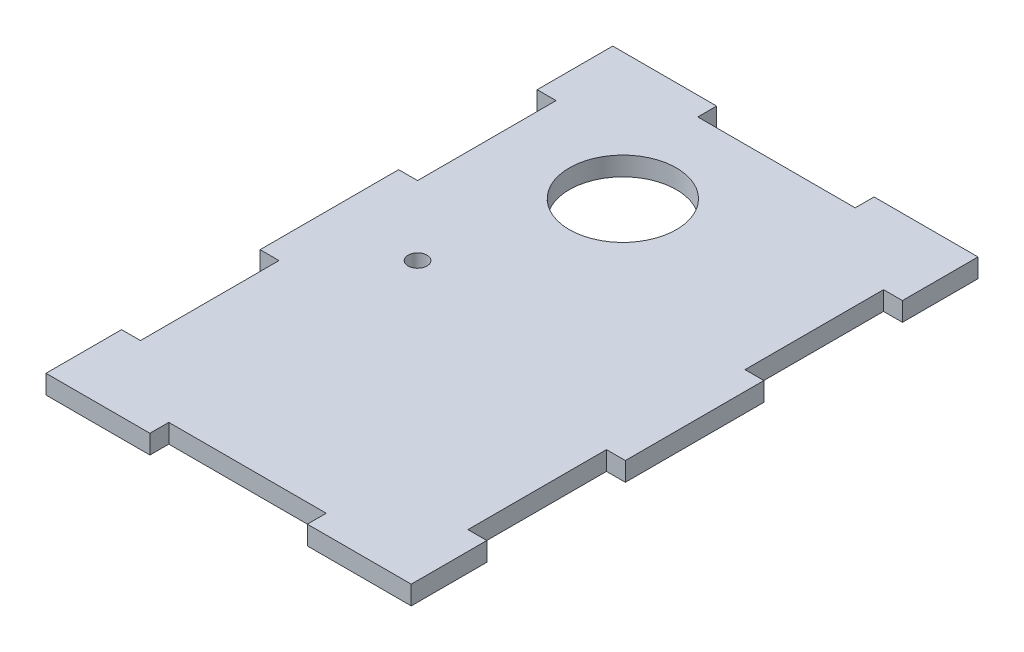
ISO-10303-21;
HEADER;
FILE_DESCRIPTION(('STEP AP214'),'2;1');
FILE_NAME('part.step','',(''),(''),'','','');
FILE_SCHEMA(('AUTOMOTIVE_DESIGN { 1 0 10303 214 1 1 1 1 }'));
ENDSEC;
DATA;
#1=APPLICATION_CONTEXT('core data for automotive mechanical design processes');
#2=APPLICATION_PROTOCOL_DEFINITION('international standard','automotive_design',2000,#1);
#3=PRODUCT_CONTEXT('',#1,'mechanical');
#4=PRODUCT('Part','Part','',(#3));
#5=PRODUCT_RELATED_PRODUCT_CATEGORY('part','',(#4));
#6=PRODUCT_DEFINITION_FORMATION('','',#4);
#7=PRODUCT_DEFINITION_CONTEXT('part definition',#1,'design');
#8=PRODUCT_DEFINITION('design','',#6,#7);
#9=PRODUCT_DEFINITION_SHAPE('','',#8);
#10=(LENGTH_UNIT() NAMED_UNIT(*) SI_UNIT(.MILLI.,.METRE.));
#11=(NAMED_UNIT(*) PLANE_ANGLE_UNIT() SI_UNIT($,.RADIAN.));
#12=(NAMED_UNIT(*) SI_UNIT($,.STERADIAN.) SOLID_ANGLE_UNIT());
#13=UNCERTAINTY_MEASURE_WITH_UNIT(LENGTH_MEASURE(1.E-05),#10,'distance_accuracy_value','');
#14=(GEOMETRIC_REPRESENTATION_CONTEXT(3) GLOBAL_UNCERTAINTY_ASSIGNED_CONTEXT((#13)) GLOBAL_UNIT_ASSIGNED_CONTEXT((#10,
#11,#12)) REPRESENTATION_CONTEXT('',''));
#15=CARTESIAN_POINT('',(0.,0.,0.));
#16=DIRECTION('',(0.,0.,1.));
#17=DIRECTION('',(1.,0.,0.));
#18=AXIS2_PLACEMENT_3D('',#15,#16,#17);
#19=CARTESIAN_POINT('',(0.,3.,0.));
#20=DIRECTION('',(0.,-1.,0.));
#21=DIRECTION('',(0.,0.,-1.));
#22=AXIS2_PLACEMENT_3D('',#19,#20,#21);
#23=PLANE('',#22);
#24=DIRECTION('',(1.,0.,0.));
#25=VECTOR('',#24,1.);
#26=CARTESIAN_POINT('',(-26.,3.,12.));
#27=LINE('',#26,#25);
#28=CARTESIAN_POINT('',(-26.,3.,12.));
#29=VERTEX_POINT('',#28);
#30=CARTESIAN_POINT('',(-23.,3.,12.));
#31=VERTEX_POINT('',#30);
#32=EDGE_CURVE('E305',#29,#31,#27,.T.);
#33=ORIENTED_EDGE('',*,*,#32,.T.);
#34=DIRECTION('',(0.,0.,1.));
#35=VECTOR('',#34,1.);
#36=CARTESIAN_POINT('',(-23.,3.,12.));
#37=LINE('',#36,#35);
#38=CARTESIAN_POINT('',(-23.,3.,34.));
#39=VERTEX_POINT('',#38);
#40=EDGE_CURVE('E153',#31,#39,#37,.T.);
#41=ORIENTED_EDGE('',*,*,#40,.T.);
#42=DIRECTION('',(-1.,0.,0.));
#43=VECTOR('',#42,1.);
#44=CARTESIAN_POINT('',(-23.,3.,34.));
#45=LINE('',#44,#43);
#46=CARTESIAN_POINT('',(-26.,3.,34.));
#47=VERTEX_POINT('',#46);
#48=EDGE_CURVE('E380',#39,#47,#45,.T.);
#49=ORIENTED_EDGE('',*,*,#48,.T.);
#50=DIRECTION('',(0.,0.,1.));
#51=VECTOR('',#50,1.);
#52=CARTESIAN_POINT('',(-26.,3.,34.));
#53=LINE('',#52,#51);
#54=CARTESIAN_POINT('',(-26.,3.,56.));
#55=VERTEX_POINT('',#54);
#56=EDGE_CURVE('E399',#47,#55,#53,.T.);
#57=ORIENTED_EDGE('',*,*,#56,.T.);
#58=DIRECTION('',(1.,0.,0.));
#59=VECTOR('',#58,1.);
#60=CARTESIAN_POINT('',(-26.,3.,56.));
#61=LINE('',#60,#59);
#62=CARTESIAN_POINT('',(-23.,3.,56.));
#63=VERTEX_POINT('',#62);
#64=EDGE_CURVE('E396',#55,#63,#61,.T.);
#65=ORIENTED_EDGE('',*,*,#64,.T.);
#66=DIRECTION('',(0.,0.,1.));
#67=VECTOR('',#66,1.);
#68=CARTESIAN_POINT('',(-23.,3.,56.));
#69=LINE('',#68,#67);
#70=CARTESIAN_POINT('',(-23.,3.,78.));
#71=VERTEX_POINT('',#70);
#72=EDGE_CURVE('E398',#63,#71,#69,.T.);
#73=ORIENTED_EDGE('',*,*,#72,.T.);
#74=DIRECTION('',(-1.,0.,0.));
#75=VECTOR('',#74,1.);
#76=CARTESIAN_POINT('',(-23.,3.,78.));
#77=LINE('',#76,#75);
#78=CARTESIAN_POINT('',(-26.,3.,78.));
#79=VERTEX_POINT('',#78);
#80=EDGE_CURVE('E401',#71,#79,#77,.T.);
#81=ORIENTED_EDGE('',*,*,#80,.T.);
#82=DIRECTION('',(0.,0.,1.));
#83=VECTOR('',#82,1.);
#84=CARTESIAN_POINT('',(-26.,3.,78.));
#85=LINE('',#84,#83);
#86=CARTESIAN_POINT('',(-26.,3.,90.));
#87=VERTEX_POINT('',#86);
#88=EDGE_CURVE('E407',#79,#87,#85,.T.);
#89=ORIENTED_EDGE('',*,*,#88,.T.);
#90=DIRECTION('',(1.,0.,0.));
#91=VECTOR('',#90,1.);
#92=CARTESIAN_POINT('',(-26.,3.,90.));
#93=LINE('',#92,#91);
#94=CARTESIAN_POINT('',(-9.49999999999999,3.,90.));
#95=VERTEX_POINT('',#94);
#96=EDGE_CURVE('E409',#87,#95,#93,.T.);
#97=ORIENTED_EDGE('',*,*,#96,.T.);
#98=DIRECTION('',(0.,0.,-1.));
#99=VECTOR('',#98,1.);
#100=CARTESIAN_POINT('',(-9.49999999999999,3.,90.));
#101=LINE('',#100,#99);
#102=CARTESIAN_POINT('',(-9.49999999999999,3.,87.));
#103=VERTEX_POINT('',#102);
#104=EDGE_CURVE('E411',#95,#103,#101,.T.);
#105=ORIENTED_EDGE('',*,*,#104,.T.);
#106=DIRECTION('',(1.,0.,0.));
#107=VECTOR('',#106,1.);
#108=CARTESIAN_POINT('',(-9.49999999999999,3.,87.));
#109=LINE('',#108,#107);
#110=CARTESIAN_POINT('',(15.5,3.,87.));
#111=VERTEX_POINT('',#110);
#112=EDGE_CURVE('E413',#103,#111,#109,.T.);
#113=ORIENTED_EDGE('',*,*,#112,.T.);
#114=DIRECTION('',(0.,0.,1.));
#115=VECTOR('',#114,1.);
#116=CARTESIAN_POINT('',(15.5,3.,87.));
#117=LINE('',#116,#115);
#118=CARTESIAN_POINT('',(15.5,3.,90.));
#119=VERTEX_POINT('',#118);
#120=EDGE_CURVE('E415',#111,#119,#117,.T.);
#121=ORIENTED_EDGE('',*,*,#120,.T.);
#122=DIRECTION('',(1.,0.,0.));
#123=VECTOR('',#122,1.);
#124=CARTESIAN_POINT('',(15.5,3.,90.));
#125=LINE('',#124,#123);
#126=CARTESIAN_POINT('',(32.,3.,90.));
#127=VERTEX_POINT('',#126);
#128=EDGE_CURVE('E417',#119,#127,#125,.T.);
#129=ORIENTED_EDGE('',*,*,#128,.T.);
#130=DIRECTION('',(0.,0.,-1.));
#131=VECTOR('',#130,1.);
#132=CARTESIAN_POINT('',(32.,3.,78.));
#133=LINE('',#132,#131);
#134=CARTESIAN_POINT('',(32.,3.,78.));
#135=VERTEX_POINT('',#134);
#136=EDGE_CURVE('E419',#127,#135,#133,.T.);
#137=ORIENTED_EDGE('',*,*,#136,.T.);
#138=DIRECTION('',(-1.,0.,0.));
#139=VECTOR('',#138,1.);
#140=CARTESIAN_POINT('',(32.,3.,78.));
#141=LINE('',#140,#139);
#142=CARTESIAN_POINT('',(29.,3.,78.));
#143=VERTEX_POINT('',#142);
#144=EDGE_CURVE('E421',#135,#143,#141,.T.);
#145=ORIENTED_EDGE('',*,*,#144,.T.);
#146=DIRECTION('',(0.,0.,-1.));
#147=VECTOR('',#146,1.);
#148=CARTESIAN_POINT('',(29.,3.,78.));
#149=LINE('',#148,#147);
#150=CARTESIAN_POINT('',(29.,3.,56.));
#151=VERTEX_POINT('',#150);
#152=EDGE_CURVE('E423',#143,#151,#149,.T.);
#153=ORIENTED_EDGE('',*,*,#152,.T.);
#154=DIRECTION('',(1.,0.,0.));
#155=VECTOR('',#154,1.);
#156=CARTESIAN_POINT('',(29.,3.,56.));
#157=LINE('',#156,#155);
#158=CARTESIAN_POINT('',(32.,3.,56.));
#159=VERTEX_POINT('',#158);
#160=EDGE_CURVE('E425',#151,#159,#157,.T.);
#161=ORIENTED_EDGE('',*,*,#160,.T.);
#162=DIRECTION('',(0.,0.,-1.));
#163=VECTOR('',#162,1.);
#164=CARTESIAN_POINT('',(32.,3.,34.));
#165=LINE('',#164,#163);
#166=CARTESIAN_POINT('',(32.,3.,34.));
#167=VERTEX_POINT('',#166);
#168=EDGE_CURVE('E427',#159,#167,#165,.T.);
#169=ORIENTED_EDGE('',*,*,#168,.T.);
#170=DIRECTION('',(-1.,0.,0.));
#171=VECTOR('',#170,1.);
#172=CARTESIAN_POINT('',(29.,3.,34.));
#173=LINE('',#172,#171);
#174=CARTESIAN_POINT('',(29.,3.,34.));
#175=VERTEX_POINT('',#174);
#176=EDGE_CURVE('E429',#167,#175,#173,.T.);
#177=ORIENTED_EDGE('',*,*,#176,.T.);
#178=DIRECTION('',(0.,0.,-1.));
#179=VECTOR('',#178,1.);
#180=CARTESIAN_POINT('',(29.,3.,12.));
#181=LINE('',#180,#179);
#182=CARTESIAN_POINT('',(29.,3.,12.));
#183=VERTEX_POINT('',#182);
#184=EDGE_CURVE('E431',#175,#183,#181,.T.);
#185=ORIENTED_EDGE('',*,*,#184,.T.);
#186=DIRECTION('',(1.,0.,0.));
#187=VECTOR('',#186,1.);
#188=CARTESIAN_POINT('',(32.,3.,12.));
#189=LINE('',#188,#187);
#190=CARTESIAN_POINT('',(32.,3.,12.));
#191=VERTEX_POINT('',#190);
#192=EDGE_CURVE('E433',#183,#191,#189,.T.);
#193=ORIENTED_EDGE('',*,*,#192,.T.);
#194=DIRECTION('',(0.,0.,-1.));
#195=VECTOR('',#194,1.);
#196=CARTESIAN_POINT('',(32.,3.,0.));
#197=LINE('',#196,#195);
#198=CARTESIAN_POINT('',(32.,3.,0.));
#199=VERTEX_POINT('',#198);
#200=EDGE_CURVE('E435',#191,#199,#197,.T.);
#201=ORIENTED_EDGE('',*,*,#200,.T.);
#202=DIRECTION('',(-1.,0.,0.));
#203=VECTOR('',#202,1.);
#204=CARTESIAN_POINT('',(15.5,3.,0.));
#205=LINE('',#204,#203);
#206=CARTESIAN_POINT('',(15.5,3.,0.));
#207=VERTEX_POINT('',#206);
#208=EDGE_CURVE('E437',#199,#207,#205,.T.);
#209=ORIENTED_EDGE('',*,*,#208,.T.);
#210=DIRECTION('',(0.,0.,1.));
#211=VECTOR('',#210,1.);
#212=CARTESIAN_POINT('',(15.5,3.,3.));
#213=LINE('',#212,#211);
#214=CARTESIAN_POINT('',(15.5,3.,3.));
#215=VERTEX_POINT('',#214);
#216=EDGE_CURVE('E439',#207,#215,#213,.T.);
#217=ORIENTED_EDGE('',*,*,#216,.T.);
#218=DIRECTION('',(-1.,0.,0.));
#219=VECTOR('',#218,1.);
#220=CARTESIAN_POINT('',(-9.5,3.,3.));
#221=LINE('',#220,#219);
#222=CARTESIAN_POINT('',(-9.5,3.,3.));
#223=VERTEX_POINT('',#222);
#224=EDGE_CURVE('E232',#215,#223,#221,.T.);
#225=ORIENTED_EDGE('',*,*,#224,.T.);
#226=DIRECTION('',(0.,0.,-1.));
#227=VECTOR('',#226,1.);
#228=CARTESIAN_POINT('',(-9.5,3.,0.));
#229=LINE('',#228,#227);
#230=CARTESIAN_POINT('',(-9.5,3.,0.));
#231=VERTEX_POINT('',#230);
#232=EDGE_CURVE('E226',#223,#231,#229,.T.);
#233=ORIENTED_EDGE('',*,*,#232,.T.);
#234=DIRECTION('',(-1.,0.,0.));
#235=VECTOR('',#234,1.);
#236=CARTESIAN_POINT('',(-26.,3.,0.));
#237=LINE('',#236,#235);
#238=CARTESIAN_POINT('',(-26.,3.,0.));
#239=VERTEX_POINT('',#238);
#240=EDGE_CURVE('E230',#231,#239,#237,.T.);
#241=ORIENTED_EDGE('',*,*,#240,.T.);
#242=DIRECTION('',(0.,0.,1.));
#243=VECTOR('',#242,1.);
#244=CARTESIAN_POINT('',(-26.,3.,0.));
#245=LINE('',#244,#243);
#246=EDGE_CURVE('E50',#239,#29,#245,.T.);
#247=ORIENTED_EDGE('',*,*,#246,.T.);
#248=EDGE_LOOP('',(#33,#41,#49,#57,#65,#73,#81,#89,#97,#105,#113,#121,#129,#137,#145,#153,#161,
#169,#177,#185,#193,#201,#209,#217,#225,#233,#241,#247));
#249=FACE_BOUND('',#248,.T.);
#250=CARTESIAN_POINT('',(-4.2,3.,20.1975807631594));
#251=DIRECTION('',(0.,1.,0.));
#252=DIRECTION('',(0.,0.,1.));
#253=AXIS2_PLACEMENT_3D('',#250,#251,#252);
#254=CIRCLE('',#253,8.5);
#255=CARTESIAN_POINT('',(-4.2,3.,28.6975807631594));
#256=VERTEX_POINT('',#255);
#257=EDGE_CURVE('E254',#256,#256,#254,.T.);
#258=ORIENTED_EDGE('',*,*,#257,.F.);
#259=EDGE_LOOP('',(#258));
#260=FACE_BOUND('',#259,.T.);
#261=CARTESIAN_POINT('',(-12.,3.,45.));
#262=DIRECTION('',(0.,1.,0.));
#263=DIRECTION('',(0.,0.,1.));
#264=AXIS2_PLACEMENT_3D('',#261,#262,#263);
#265=CIRCLE('',#264,1.5);
#266=CARTESIAN_POINT('',(-12.,3.,46.5));
#267=VERTEX_POINT('',#266);
#268=EDGE_CURVE('E480',#267,#267,#265,.T.);
#269=ORIENTED_EDGE('',*,*,#268,.F.);
#270=EDGE_LOOP('',(#269));
#271=FACE_BOUND('',#270,.T.);
#272=ADVANCED_FACE('F33',(#249,#260,#271),#23,.F.);
#273=CARTESIAN_POINT('',(0.,0.,0.));
#274=DIRECTION('',(0.,-1.,0.));
#275=DIRECTION('',(0.,0.,-1.));
#276=AXIS2_PLACEMENT_3D('',#273,#274,#275);
#277=PLANE('',#276);
#278=CARTESIAN_POINT('',(-4.2,0.,20.1975807631594));
#279=DIRECTION('',(0.,1.,0.));
#280=DIRECTION('',(0.,0.,1.));
#281=AXIS2_PLACEMENT_3D('',#278,#279,#280);
#282=CIRCLE('',#281,8.5);
#283=CARTESIAN_POINT('',(-4.2,0.,28.6975807631594));
#284=VERTEX_POINT('',#283);
#285=EDGE_CURVE('E485',#284,#284,#282,.T.);
#286=ORIENTED_EDGE('',*,*,#285,.T.);
#287=EDGE_LOOP('',(#286));
#288=FACE_BOUND('',#287,.T.);
#289=DIRECTION('',(1.,0.,0.));
#290=VECTOR('',#289,1.);
#291=CARTESIAN_POINT('',(-26.,0.,12.));
#292=LINE('',#291,#290);
#293=CARTESIAN_POINT('',(-26.,0.,12.));
#294=VERTEX_POINT('',#293);
#295=CARTESIAN_POINT('',(-23.,0.,12.));
#296=VERTEX_POINT('',#295);
#297=EDGE_CURVE('E250',#294,#296,#292,.T.);
#298=ORIENTED_EDGE('',*,*,#297,.F.);
#299=DIRECTION('',(0.,0.,1.));
#300=VECTOR('',#299,1.);
#301=CARTESIAN_POINT('',(-26.,0.,0.));
#302=LINE('',#301,#300);
#303=CARTESIAN_POINT('',(-26.,0.,0.));
#304=VERTEX_POINT('',#303);
#305=EDGE_CURVE('E145',#304,#294,#302,.T.);
#306=ORIENTED_EDGE('',*,*,#305,.F.);
#307=DIRECTION('',(-1.,0.,0.));
#308=VECTOR('',#307,1.);
#309=CARTESIAN_POINT('',(-26.,0.,0.));
#310=LINE('',#309,#308);
#311=CARTESIAN_POINT('',(-9.5,0.,0.));
#312=VERTEX_POINT('',#311);
#313=EDGE_CURVE('E139',#312,#304,#310,.T.);
#314=ORIENTED_EDGE('',*,*,#313,.F.);
#315=DIRECTION('',(0.,0.,-1.));
#316=VECTOR('',#315,1.);
#317=CARTESIAN_POINT('',(-9.5,0.,0.));
#318=LINE('',#317,#316);
#319=CARTESIAN_POINT('',(-9.5,0.,3.));
#320=VERTEX_POINT('',#319);
#321=EDGE_CURVE('E240',#320,#312,#318,.T.);
#322=ORIENTED_EDGE('',*,*,#321,.F.);
#323=DIRECTION('',(-1.,0.,0.));
#324=VECTOR('',#323,1.);
#325=CARTESIAN_POINT('',(-9.5,0.,3.));
#326=LINE('',#325,#324);
#327=CARTESIAN_POINT('',(15.5,0.,3.));
#328=VERTEX_POINT('',#327);
#329=EDGE_CURVE('E300',#328,#320,#326,.T.);
#330=ORIENTED_EDGE('',*,*,#329,.F.);
#331=DIRECTION('',(0.,0.,1.));
#332=VECTOR('',#331,1.);
#333=CARTESIAN_POINT('',(15.5,0.,3.));
#334=LINE('',#333,#332);
#335=CARTESIAN_POINT('',(15.5,0.,0.));
#336=VERTEX_POINT('',#335);
#337=EDGE_CURVE('E298',#336,#328,#334,.T.);
#338=ORIENTED_EDGE('',*,*,#337,.F.);
#339=DIRECTION('',(-1.,0.,0.));
#340=VECTOR('',#339,1.);
#341=CARTESIAN_POINT('',(15.5,0.,0.));
#342=LINE('',#341,#340);
#343=CARTESIAN_POINT('',(32.,0.,0.));
#344=VERTEX_POINT('',#343);
#345=EDGE_CURVE('E296',#344,#336,#342,.T.);
#346=ORIENTED_EDGE('',*,*,#345,.F.);
#347=DIRECTION('',(0.,0.,-1.));
#348=VECTOR('',#347,1.);
#349=CARTESIAN_POINT('',(32.,0.,0.));
#350=LINE('',#349,#348);
#351=CARTESIAN_POINT('',(32.,0.,12.));
#352=VERTEX_POINT('',#351);
#353=EDGE_CURVE('E294',#352,#344,#350,.T.);
#354=ORIENTED_EDGE('',*,*,#353,.F.);
#355=DIRECTION('',(1.,0.,0.));
#356=VECTOR('',#355,1.);
#357=CARTESIAN_POINT('',(32.,0.,12.));
#358=LINE('',#357,#356);
#359=CARTESIAN_POINT('',(29.,0.,12.));
#360=VERTEX_POINT('',#359);
#361=EDGE_CURVE('E292',#360,#352,#358,.T.);
#362=ORIENTED_EDGE('',*,*,#361,.F.);
#363=DIRECTION('',(0.,0.,-1.));
#364=VECTOR('',#363,1.);
#365=CARTESIAN_POINT('',(29.,0.,12.));
#366=LINE('',#365,#364);
#367=CARTESIAN_POINT('',(29.,0.,34.));
#368=VERTEX_POINT('',#367);
#369=EDGE_CURVE('E290',#368,#360,#366,.T.);
#370=ORIENTED_EDGE('',*,*,#369,.F.);
#371=DIRECTION('',(-1.,0.,0.));
#372=VECTOR('',#371,1.);
#373=CARTESIAN_POINT('',(29.,0.,34.));
#374=LINE('',#373,#372);
#375=CARTESIAN_POINT('',(32.,0.,34.));
#376=VERTEX_POINT('',#375);
#377=EDGE_CURVE('E288',#376,#368,#374,.T.);
#378=ORIENTED_EDGE('',*,*,#377,.F.);
#379=DIRECTION('',(0.,0.,-1.));
#380=VECTOR('',#379,1.);
#381=CARTESIAN_POINT('',(32.,0.,34.));
#382=LINE('',#381,#380);
#383=CARTESIAN_POINT('',(32.,0.,56.));
#384=VERTEX_POINT('',#383);
#385=EDGE_CURVE('E286',#384,#376,#382,.T.);
#386=ORIENTED_EDGE('',*,*,#385,.F.);
#387=DIRECTION('',(1.,0.,0.));
#388=VECTOR('',#387,1.);
#389=CARTESIAN_POINT('',(29.,0.,56.));
#390=LINE('',#389,#388);
#391=CARTESIAN_POINT('',(29.,0.,56.));
#392=VERTEX_POINT('',#391);
#393=EDGE_CURVE('E284',#392,#384,#390,.T.);
#394=ORIENTED_EDGE('',*,*,#393,.F.);
#395=DIRECTION('',(0.,0.,-1.));
#396=VECTOR('',#395,1.);
#397=CARTESIAN_POINT('',(29.,0.,78.));
#398=LINE('',#397,#396);
#399=CARTESIAN_POINT('',(29.,0.,78.));
#400=VERTEX_POINT('',#399);
#401=EDGE_CURVE('E282',#400,#392,#398,.T.);
#402=ORIENTED_EDGE('',*,*,#401,.F.);
#403=DIRECTION('',(-1.,0.,0.));
#404=VECTOR('',#403,1.);
#405=CARTESIAN_POINT('',(32.,0.,78.));
#406=LINE('',#405,#404);
#407=CARTESIAN_POINT('',(32.,0.,78.));
#408=VERTEX_POINT('',#407);
#409=EDGE_CURVE('E280',#408,#400,#406,.T.);
#410=ORIENTED_EDGE('',*,*,#409,.F.);
#411=DIRECTION('',(0.,0.,-1.));
#412=VECTOR('',#411,1.);
#413=CARTESIAN_POINT('',(32.,0.,78.));
#414=LINE('',#413,#412);
#415=CARTESIAN_POINT('',(32.,0.,90.));
#416=VERTEX_POINT('',#415);
#417=EDGE_CURVE('E278',#416,#408,#414,.T.);
#418=ORIENTED_EDGE('',*,*,#417,.F.);
#419=DIRECTION('',(1.,0.,0.));
#420=VECTOR('',#419,1.);
#421=CARTESIAN_POINT('',(15.5,0.,90.));
#422=LINE('',#421,#420);
#423=CARTESIAN_POINT('',(15.5,0.,90.));
#424=VERTEX_POINT('',#423);
#425=EDGE_CURVE('E276',#424,#416,#422,.T.);
#426=ORIENTED_EDGE('',*,*,#425,.F.);
#427=DIRECTION('',(0.,0.,1.));
#428=VECTOR('',#427,1.);
#429=CARTESIAN_POINT('',(15.5,0.,87.));
#430=LINE('',#429,#428);
#431=CARTESIAN_POINT('',(15.5,0.,87.));
#432=VERTEX_POINT('',#431);
#433=EDGE_CURVE('E274',#432,#424,#430,.T.);
#434=ORIENTED_EDGE('',*,*,#433,.F.);
#435=DIRECTION('',(1.,0.,0.));
#436=VECTOR('',#435,1.);
#437=CARTESIAN_POINT('',(-9.49999999999999,0.,87.));
#438=LINE('',#437,#436);
#439=CARTESIAN_POINT('',(-9.49999999999999,0.,87.));
#440=VERTEX_POINT('',#439);
#441=EDGE_CURVE('E272',#440,#432,#438,.T.);
#442=ORIENTED_EDGE('',*,*,#441,.F.);
#443=DIRECTION('',(0.,0.,-1.));
#444=VECTOR('',#443,1.);
#445=CARTESIAN_POINT('',(-9.49999999999999,0.,90.));
#446=LINE('',#445,#444);
#447=CARTESIAN_POINT('',(-9.49999999999999,0.,90.));
#448=VERTEX_POINT('',#447);
#449=EDGE_CURVE('E270',#448,#440,#446,.T.);
#450=ORIENTED_EDGE('',*,*,#449,.F.);
#451=DIRECTION('',(1.,0.,0.));
#452=VECTOR('',#451,1.);
#453=CARTESIAN_POINT('',(-26.,0.,90.));
#454=LINE('',#453,#452);
#455=CARTESIAN_POINT('',(-26.,0.,90.));
#456=VERTEX_POINT('',#455);
#457=EDGE_CURVE('E268',#456,#448,#454,.T.);
#458=ORIENTED_EDGE('',*,*,#457,.F.);
#459=DIRECTION('',(0.,0.,1.));
#460=VECTOR('',#459,1.);
#461=CARTESIAN_POINT('',(-26.,0.,78.));
#462=LINE('',#461,#460);
#463=CARTESIAN_POINT('',(-26.,0.,78.));
#464=VERTEX_POINT('',#463);
#465=EDGE_CURVE('E266',#464,#456,#462,.T.);
#466=ORIENTED_EDGE('',*,*,#465,.F.);
#467=DIRECTION('',(-1.,0.,0.));
#468=VECTOR('',#467,1.);
#469=CARTESIAN_POINT('',(-23.,0.,78.));
#470=LINE('',#469,#468);
#471=CARTESIAN_POINT('',(-23.,0.,78.));
#472=VERTEX_POINT('',#471);
#473=EDGE_CURVE('E264',#472,#464,#470,.T.);
#474=ORIENTED_EDGE('',*,*,#473,.F.);
#475=DIRECTION('',(0.,0.,1.));
#476=VECTOR('',#475,1.);
#477=CARTESIAN_POINT('',(-23.,0.,56.));
#478=LINE('',#477,#476);
#479=CARTESIAN_POINT('',(-23.,0.,56.));
#480=VERTEX_POINT('',#479);
#481=EDGE_CURVE('E262',#480,#472,#478,.T.);
#482=ORIENTED_EDGE('',*,*,#481,.F.);
#483=DIRECTION('',(1.,0.,0.));
#484=VECTOR('',#483,1.);
#485=CARTESIAN_POINT('',(-26.,0.,56.));
#486=LINE('',#485,#484);
#487=CARTESIAN_POINT('',(-26.,0.,56.));
#488=VERTEX_POINT('',#487);
#489=EDGE_CURVE('E260',#488,#480,#486,.T.);
#490=ORIENTED_EDGE('',*,*,#489,.F.);
#491=DIRECTION('',(0.,0.,1.));
#492=VECTOR('',#491,1.);
#493=CARTESIAN_POINT('',(-26.,0.,34.));
#494=LINE('',#493,#492);
#495=CARTESIAN_POINT('',(-26.,0.,34.));
#496=VERTEX_POINT('',#495);
#497=EDGE_CURVE('E258',#496,#488,#494,.T.);
#498=ORIENTED_EDGE('',*,*,#497,.F.);
#499=DIRECTION('',(-1.,0.,0.));
#500=VECTOR('',#499,1.);
#501=CARTESIAN_POINT('',(-23.,0.,34.));
#502=LINE('',#501,#500);
#503=CARTESIAN_POINT('',(-23.,0.,34.));
#504=VERTEX_POINT('',#503);
#505=EDGE_CURVE('E256',#504,#496,#502,.T.);
#506=ORIENTED_EDGE('',*,*,#505,.F.);
#507=DIRECTION('',(0.,0.,1.));
#508=VECTOR('',#507,1.);
#509=CARTESIAN_POINT('',(-23.,0.,12.));
#510=LINE('',#509,#508);
#511=EDGE_CURVE('E253',#296,#504,#510,.T.);
#512=ORIENTED_EDGE('',*,*,#511,.F.);
#513=EDGE_LOOP('',(#298,#306,#314,#322,#330,#338,#346,#354,#362,#370,#378,#386,#394,#402,#410,
#418,#426,#434,#442,#450,#458,#466,#474,#482,#490,#498,#506,#512));
#514=FACE_BOUND('',#513,.T.);
#515=CARTESIAN_POINT('',(-12.,0.,45.));
#516=DIRECTION('',(0.,1.,0.));
#517=DIRECTION('',(0.,0.,1.));
#518=AXIS2_PLACEMENT_3D('',#515,#516,#517);
#519=CIRCLE('',#518,1.5);
#520=CARTESIAN_POINT('',(-12.,0.,46.5));
#521=VERTEX_POINT('',#520);
#522=EDGE_CURVE('E483',#521,#521,#519,.T.);
#523=ORIENTED_EDGE('',*,*,#522,.T.);
#524=EDGE_LOOP('',(#523));
#525=FACE_BOUND('',#524,.T.);
#526=ADVANCED_FACE('F384',(#288,#514,#525),#277,.T.);
#527=CARTESIAN_POINT('',(-26.,3.,12.));
#528=DIRECTION('',(0.,0.,-1.));
#529=DIRECTION('',(-1.,0.,0.));
#530=AXIS2_PLACEMENT_3D('',#527,#528,#529);
#531=PLANE('',#530);
#532=ORIENTED_EDGE('',*,*,#297,.T.);
#533=DIRECTION('',(0.,-1.,0.));
#534=VECTOR('',#533,1.);
#535=CARTESIAN_POINT('',(-23.,3.,12.));
#536=LINE('',#535,#534);
#537=EDGE_CURVE('E11',#31,#296,#536,.T.);
#538=ORIENTED_EDGE('',*,*,#537,.F.);
#539=ORIENTED_EDGE('',*,*,#32,.F.);
#540=DIRECTION('',(0.,-1.,0.));
#541=VECTOR('',#540,1.);
#542=CARTESIAN_POINT('',(-26.,3.,12.));
#543=LINE('',#542,#541);
#544=EDGE_CURVE('E246',#29,#294,#543,.T.);
#545=ORIENTED_EDGE('',*,*,#544,.T.);
#546=EDGE_LOOP('',(#532,#538,#539,#545));
#547=FACE_BOUND('',#546,.T.);
#548=ADVANCED_FACE('F35',(#547),#531,.F.);
#549=CARTESIAN_POINT('',(-23.,3.,12.));
#550=DIRECTION('',(1.,0.,0.));
#551=DIRECTION('',(0.,0.,-1.));
#552=AXIS2_PLACEMENT_3D('',#549,#550,#551);
#553=PLANE('',#552);
#554=ORIENTED_EDGE('',*,*,#511,.T.);
#555=DIRECTION('',(0.,-1.,0.));
#556=VECTOR('',#555,1.);
#557=CARTESIAN_POINT('',(-23.,3.,34.));
#558=LINE('',#557,#556);
#559=EDGE_CURVE('E42',#39,#504,#558,.T.);
#560=ORIENTED_EDGE('',*,*,#559,.F.);
#561=ORIENTED_EDGE('',*,*,#40,.F.);
#562=ORIENTED_EDGE('',*,*,#537,.T.);
#563=EDGE_LOOP('',(#554,#560,#561,#562));
#564=FACE_BOUND('',#563,.T.);
#565=ADVANCED_FACE('F740',(#564),#553,.F.);
#566=CARTESIAN_POINT('',(-23.,3.,34.));
#567=DIRECTION('',(0.,0.,1.));
#568=DIRECTION('',(1.,0.,0.));
#569=AXIS2_PLACEMENT_3D('',#566,#567,#568);
#570=PLANE('',#569);
#571=ORIENTED_EDGE('',*,*,#505,.T.);
#572=DIRECTION('',(0.,-1.,0.));
#573=VECTOR('',#572,1.);
#574=CARTESIAN_POINT('',(-26.,3.,34.));
#575=LINE('',#574,#573);
#576=EDGE_CURVE('E372',#47,#496,#575,.T.);
#577=ORIENTED_EDGE('',*,*,#576,.F.);
#578=ORIENTED_EDGE('',*,*,#48,.F.);
#579=ORIENTED_EDGE('',*,*,#559,.T.);
#580=EDGE_LOOP('',(#571,#577,#578,#579));
#581=FACE_BOUND('',#580,.T.);
#582=ADVANCED_FACE('F378',(#581),#570,.F.);
#583=CARTESIAN_POINT('',(-26.,3.,34.));
#584=DIRECTION('',(1.,0.,0.));
#585=DIRECTION('',(0.,0.,-1.));
#586=AXIS2_PLACEMENT_3D('',#583,#584,#585);
#587=PLANE('',#586);
#588=ORIENTED_EDGE('',*,*,#497,.T.);
#589=DIRECTION('',(0.,-1.,0.));
#590=VECTOR('',#589,1.);
#591=CARTESIAN_POINT('',(-26.,3.,56.));
#592=LINE('',#591,#590);
#593=EDGE_CURVE('E369',#55,#488,#592,.T.);
#594=ORIENTED_EDGE('',*,*,#593,.F.);
#595=ORIENTED_EDGE('',*,*,#56,.F.);
#596=ORIENTED_EDGE('',*,*,#576,.T.);
#597=EDGE_LOOP('',(#588,#594,#595,#596));
#598=FACE_BOUND('',#597,.T.);
#599=ADVANCED_FACE('F390',(#598),#587,.F.);
#600=CARTESIAN_POINT('',(-26.,3.,56.));
#601=DIRECTION('',(0.,0.,-1.));
#602=DIRECTION('',(-1.,0.,0.));
#603=AXIS2_PLACEMENT_3D('',#600,#601,#602);
#604=PLANE('',#603);
#605=ORIENTED_EDGE('',*,*,#489,.T.);
#606=DIRECTION('',(0.,-1.,0.));
#607=VECTOR('',#606,1.);
#608=CARTESIAN_POINT('',(-23.,3.,56.));
#609=LINE('',#608,#607);
#610=EDGE_CURVE('E366',#63,#480,#609,.T.);
#611=ORIENTED_EDGE('',*,*,#610,.F.);
#612=ORIENTED_EDGE('',*,*,#64,.F.);
#613=ORIENTED_EDGE('',*,*,#593,.T.);
#614=EDGE_LOOP('',(#605,#611,#612,#613));
#615=FACE_BOUND('',#614,.T.);
#616=ADVANCED_FACE('F394',(#615),#604,.F.);
#617=CARTESIAN_POINT('',(-23.,3.,56.));
#618=DIRECTION('',(1.,0.,0.));
#619=DIRECTION('',(0.,0.,-1.));
#620=AXIS2_PLACEMENT_3D('',#617,#618,#619);
#621=PLANE('',#620);
#622=ORIENTED_EDGE('',*,*,#481,.T.);
#623=DIRECTION('',(0.,-1.,0.));
#624=VECTOR('',#623,1.);
#625=CARTESIAN_POINT('',(-23.,3.,78.));
#626=LINE('',#625,#624);
#627=EDGE_CURVE('E363',#71,#472,#626,.T.);
#628=ORIENTED_EDGE('',*,*,#627,.F.);
#629=ORIENTED_EDGE('',*,*,#72,.F.);
#630=ORIENTED_EDGE('',*,*,#610,.T.);
#631=EDGE_LOOP('',(#622,#628,#629,#630));
#632=FACE_BOUND('',#631,.T.);
#633=ADVANCED_FACE('F705',(#632),#621,.F.);
#634=CARTESIAN_POINT('',(-23.,3.,78.));
#635=DIRECTION('',(0.,0.,1.));
#636=DIRECTION('',(1.,0.,0.));
#637=AXIS2_PLACEMENT_3D('',#634,#635,#636);
#638=PLANE('',#637);
#639=ORIENTED_EDGE('',*,*,#473,.T.);
#640=DIRECTION('',(0.,-1.,0.));
#641=VECTOR('',#640,1.);
#642=CARTESIAN_POINT('',(-26.,3.,78.));
#643=LINE('',#642,#641);
#644=EDGE_CURVE('E360',#79,#464,#643,.T.);
#645=ORIENTED_EDGE('',*,*,#644,.F.);
#646=ORIENTED_EDGE('',*,*,#80,.F.);
#647=ORIENTED_EDGE('',*,*,#627,.T.);
#648=EDGE_LOOP('',(#639,#645,#646,#647));
#649=FACE_BOUND('',#648,.T.);
#650=ADVANCED_FACE('F695',(#649),#638,.F.);
#651=CARTESIAN_POINT('',(-26.,3.,78.));
#652=DIRECTION('',(1.,0.,0.));
#653=DIRECTION('',(0.,0.,-1.));
#654=AXIS2_PLACEMENT_3D('',#651,#652,#653);
#655=PLANE('',#654);
#656=ORIENTED_EDGE('',*,*,#465,.T.);
#657=DIRECTION('',(0.,-1.,0.));
#658=VECTOR('',#657,1.);
#659=CARTESIAN_POINT('',(-26.,3.,90.));
#660=LINE('',#659,#658);
#661=EDGE_CURVE('E357',#87,#456,#660,.T.);
#662=ORIENTED_EDGE('',*,*,#661,.F.);
#663=ORIENTED_EDGE('',*,*,#88,.F.);
#664=ORIENTED_EDGE('',*,*,#644,.T.);
#665=EDGE_LOOP('',(#656,#662,#663,#664));
#666=FACE_BOUND('',#665,.T.);
#667=ADVANCED_FACE('F685',(#666),#655,.F.);
#668=CARTESIAN_POINT('',(-26.,3.,90.));
#669=DIRECTION('',(0.,0.,-1.));
#670=DIRECTION('',(-1.,0.,0.));
#671=AXIS2_PLACEMENT_3D('',#668,#669,#670);
#672=PLANE('',#671);
#673=ORIENTED_EDGE('',*,*,#457,.T.);
#674=DIRECTION('',(0.,-1.,0.));
#675=VECTOR('',#674,1.);
#676=CARTESIAN_POINT('',(-9.49999999999999,3.,90.));
#677=LINE('',#676,#675);
#678=EDGE_CURVE('E354',#95,#448,#677,.T.);
#679=ORIENTED_EDGE('',*,*,#678,.F.);
#680=ORIENTED_EDGE('',*,*,#96,.F.);
#681=ORIENTED_EDGE('',*,*,#661,.T.);
#682=EDGE_LOOP('',(#673,#679,#680,#681));
#683=FACE_BOUND('',#682,.T.);
#684=ADVANCED_FACE('F675',(#683),#672,.F.);
#685=CARTESIAN_POINT('',(-9.49999999999999,3.,90.));
#686=DIRECTION('',(-1.,0.,0.));
#687=DIRECTION('',(0.,0.,1.));
#688=AXIS2_PLACEMENT_3D('',#685,#686,#687);
#689=PLANE('',#688);
#690=ORIENTED_EDGE('',*,*,#449,.T.);
#691=DIRECTION('',(0.,-1.,0.));
#692=VECTOR('',#691,1.);
#693=CARTESIAN_POINT('',(-9.49999999999999,3.,87.));
#694=LINE('',#693,#692);
#695=EDGE_CURVE('E351',#103,#440,#694,.T.);
#696=ORIENTED_EDGE('',*,*,#695,.F.);
#697=ORIENTED_EDGE('',*,*,#104,.F.);
#698=ORIENTED_EDGE('',*,*,#678,.T.);
#699=EDGE_LOOP('',(#690,#696,#697,#698));
#700=FACE_BOUND('',#699,.T.);
#701=ADVANCED_FACE('F665',(#700),#689,.F.);
#702=CARTESIAN_POINT('',(-9.49999999999999,3.,87.));
#703=DIRECTION('',(0.,0.,-1.));
#704=DIRECTION('',(-1.,0.,0.));
#705=AXIS2_PLACEMENT_3D('',#702,#703,#704);
#706=PLANE('',#705);
#707=ORIENTED_EDGE('',*,*,#441,.T.);
#708=DIRECTION('',(0.,-1.,0.));
#709=VECTOR('',#708,1.);
#710=CARTESIAN_POINT('',(15.5,3.,87.));
#711=LINE('',#710,#709);
#712=EDGE_CURVE('E348',#111,#432,#711,.T.);
#713=ORIENTED_EDGE('',*,*,#712,.F.);
#714=ORIENTED_EDGE('',*,*,#112,.F.);
#715=ORIENTED_EDGE('',*,*,#695,.T.);
#716=EDGE_LOOP('',(#707,#713,#714,#715));
#717=FACE_BOUND('',#716,.T.);
#718=ADVANCED_FACE('F655',(#717),#706,.F.);
#719=CARTESIAN_POINT('',(15.5,3.,87.));
#720=DIRECTION('',(1.,0.,0.));
#721=DIRECTION('',(0.,0.,-1.));
#722=AXIS2_PLACEMENT_3D('',#719,#720,#721);
#723=PLANE('',#722);
#724=ORIENTED_EDGE('',*,*,#433,.T.);
#725=DIRECTION('',(0.,-1.,0.));
#726=VECTOR('',#725,1.);
#727=CARTESIAN_POINT('',(15.5,3.,90.));
#728=LINE('',#727,#726);
#729=EDGE_CURVE('E345',#119,#424,#728,.T.);
#730=ORIENTED_EDGE('',*,*,#729,.F.);
#731=ORIENTED_EDGE('',*,*,#120,.F.);
#732=ORIENTED_EDGE('',*,*,#712,.T.);
#733=EDGE_LOOP('',(#724,#730,#731,#732));
#734=FACE_BOUND('',#733,.T.);
#735=ADVANCED_FACE('F645',(#734),#723,.F.);
#736=CARTESIAN_POINT('',(15.5,3.,90.));
#737=DIRECTION('',(0.,0.,-1.));
#738=DIRECTION('',(-1.,0.,0.));
#739=AXIS2_PLACEMENT_3D('',#736,#737,#738);
#740=PLANE('',#739);
#741=ORIENTED_EDGE('',*,*,#425,.T.);
#742=DIRECTION('',(0.,-1.,0.));
#743=VECTOR('',#742,1.);
#744=CARTESIAN_POINT('',(32.,3.,90.));
#745=LINE('',#744,#743);
#746=EDGE_CURVE('E342',#127,#416,#745,.T.);
#747=ORIENTED_EDGE('',*,*,#746,.F.);
#748=ORIENTED_EDGE('',*,*,#128,.F.);
#749=ORIENTED_EDGE('',*,*,#729,.T.);
#750=EDGE_LOOP('',(#741,#747,#748,#749));
#751=FACE_BOUND('',#750,.T.);
#752=ADVANCED_FACE('F635',(#751),#740,.F.);
#753=CARTESIAN_POINT('',(32.,3.,78.));
#754=DIRECTION('',(-1.,0.,0.));
#755=DIRECTION('',(0.,0.,1.));
#756=AXIS2_PLACEMENT_3D('',#753,#754,#755);
#757=PLANE('',#756);
#758=ORIENTED_EDGE('',*,*,#417,.T.);
#759=DIRECTION('',(0.,-1.,0.));
#760=VECTOR('',#759,1.);
#761=CARTESIAN_POINT('',(32.,3.,78.));
#762=LINE('',#761,#760);
#763=EDGE_CURVE('E339',#135,#408,#762,.T.);
#764=ORIENTED_EDGE('',*,*,#763,.F.);
#765=ORIENTED_EDGE('',*,*,#136,.F.);
#766=ORIENTED_EDGE('',*,*,#746,.T.);
#767=EDGE_LOOP('',(#758,#764,#765,#766));
#768=FACE_BOUND('',#767,.T.);
#769=ADVANCED_FACE('F625',(#768),#757,.F.);
#770=CARTESIAN_POINT('',(32.,3.,78.));
#771=DIRECTION('',(0.,0.,1.));
#772=DIRECTION('',(1.,0.,0.));
#773=AXIS2_PLACEMENT_3D('',#770,#771,#772);
#774=PLANE('',#773);
#775=ORIENTED_EDGE('',*,*,#409,.T.);
#776=DIRECTION('',(0.,-1.,0.));
#777=VECTOR('',#776,1.);
#778=CARTESIAN_POINT('',(29.,3.,78.));
#779=LINE('',#778,#777);
#780=EDGE_CURVE('E336',#143,#400,#779,.T.);
#781=ORIENTED_EDGE('',*,*,#780,.F.);
#782=ORIENTED_EDGE('',*,*,#144,.F.);
#783=ORIENTED_EDGE('',*,*,#763,.T.);
#784=EDGE_LOOP('',(#775,#781,#782,#783));
#785=FACE_BOUND('',#784,.T.);
#786=ADVANCED_FACE('F615',(#785),#774,.F.);
#787=CARTESIAN_POINT('',(29.,3.,78.));
#788=DIRECTION('',(-1.,0.,0.));
#789=DIRECTION('',(0.,0.,1.));
#790=AXIS2_PLACEMENT_3D('',#787,#788,#789);
#791=PLANE('',#790);
#792=ORIENTED_EDGE('',*,*,#401,.T.);
#793=DIRECTION('',(0.,-1.,0.));
#794=VECTOR('',#793,1.);
#795=CARTESIAN_POINT('',(29.,3.,56.));
#796=LINE('',#795,#794);
#797=EDGE_CURVE('E333',#151,#392,#796,.T.);
#798=ORIENTED_EDGE('',*,*,#797,.F.);
#799=ORIENTED_EDGE('',*,*,#152,.F.);
#800=ORIENTED_EDGE('',*,*,#780,.T.);
#801=EDGE_LOOP('',(#792,#798,#799,#800));
#802=FACE_BOUND('',#801,.T.);
#803=ADVANCED_FACE('F605',(#802),#791,.F.);
#804=CARTESIAN_POINT('',(29.,3.,56.));
#805=DIRECTION('',(0.,0.,-1.));
#806=DIRECTION('',(-1.,0.,0.));
#807=AXIS2_PLACEMENT_3D('',#804,#805,#806);
#808=PLANE('',#807);
#809=ORIENTED_EDGE('',*,*,#393,.T.);
#810=DIRECTION('',(0.,-1.,0.));
#811=VECTOR('',#810,1.);
#812=CARTESIAN_POINT('',(32.,3.,56.));
#813=LINE('',#812,#811);
#814=EDGE_CURVE('E330',#159,#384,#813,.T.);
#815=ORIENTED_EDGE('',*,*,#814,.F.);
#816=ORIENTED_EDGE('',*,*,#160,.F.);
#817=ORIENTED_EDGE('',*,*,#797,.T.);
#818=EDGE_LOOP('',(#809,#815,#816,#817));
#819=FACE_BOUND('',#818,.T.);
#820=ADVANCED_FACE('F595',(#819),#808,.F.);
#821=CARTESIAN_POINT('',(32.,3.,34.));
#822=DIRECTION('',(-1.,0.,0.));
#823=DIRECTION('',(0.,0.,1.));
#824=AXIS2_PLACEMENT_3D('',#821,#822,#823);
#825=PLANE('',#824);
#826=ORIENTED_EDGE('',*,*,#385,.T.);
#827=DIRECTION('',(0.,-1.,0.));
#828=VECTOR('',#827,1.);
#829=CARTESIAN_POINT('',(32.,3.,34.));
#830=LINE('',#829,#828);
#831=EDGE_CURVE('E327',#167,#376,#830,.T.);
#832=ORIENTED_EDGE('',*,*,#831,.F.);
#833=ORIENTED_EDGE('',*,*,#168,.F.);
#834=ORIENTED_EDGE('',*,*,#814,.T.);
#835=EDGE_LOOP('',(#826,#832,#833,#834));
#836=FACE_BOUND('',#835,.T.);
#837=ADVANCED_FACE('F585',(#836),#825,.F.);
#838=CARTESIAN_POINT('',(29.,3.,34.));
#839=DIRECTION('',(0.,0.,1.));
#840=DIRECTION('',(1.,0.,0.));
#841=AXIS2_PLACEMENT_3D('',#838,#839,#840);
#842=PLANE('',#841);
#843=ORIENTED_EDGE('',*,*,#377,.T.);
#844=DIRECTION('',(0.,-1.,0.));
#845=VECTOR('',#844,1.);
#846=CARTESIAN_POINT('',(29.,3.,34.));
#847=LINE('',#846,#845);
#848=EDGE_CURVE('E324',#175,#368,#847,.T.);
#849=ORIENTED_EDGE('',*,*,#848,.F.);
#850=ORIENTED_EDGE('',*,*,#176,.F.);
#851=ORIENTED_EDGE('',*,*,#831,.T.);
#852=EDGE_LOOP('',(#843,#849,#850,#851));
#853=FACE_BOUND('',#852,.T.);
#854=ADVANCED_FACE('F575',(#853),#842,.F.);
#855=CARTESIAN_POINT('',(29.,3.,12.));
#856=DIRECTION('',(-1.,0.,0.));
#857=DIRECTION('',(0.,0.,1.));
#858=AXIS2_PLACEMENT_3D('',#855,#856,#857);
#859=PLANE('',#858);
#860=ORIENTED_EDGE('',*,*,#369,.T.);
#861=DIRECTION('',(0.,-1.,0.));
#862=VECTOR('',#861,1.);
#863=CARTESIAN_POINT('',(29.,3.,12.));
#864=LINE('',#863,#862);
#865=EDGE_CURVE('E321',#183,#360,#864,.T.);
#866=ORIENTED_EDGE('',*,*,#865,.F.);
#867=ORIENTED_EDGE('',*,*,#184,.F.);
#868=ORIENTED_EDGE('',*,*,#848,.T.);
#869=EDGE_LOOP('',(#860,#866,#867,#868));
#870=FACE_BOUND('',#869,.T.);
#871=ADVANCED_FACE('F565',(#870),#859,.F.);
#872=CARTESIAN_POINT('',(32.,3.,12.));
#873=DIRECTION('',(0.,0.,-1.));
#874=DIRECTION('',(-1.,0.,0.));
#875=AXIS2_PLACEMENT_3D('',#872,#873,#874);
#876=PLANE('',#875);
#877=ORIENTED_EDGE('',*,*,#361,.T.);
#878=DIRECTION('',(0.,-1.,0.));
#879=VECTOR('',#878,1.);
#880=CARTESIAN_POINT('',(32.,3.,12.));
#881=LINE('',#880,#879);
#882=EDGE_CURVE('E318',#191,#352,#881,.T.);
#883=ORIENTED_EDGE('',*,*,#882,.F.);
#884=ORIENTED_EDGE('',*,*,#192,.F.);
#885=ORIENTED_EDGE('',*,*,#865,.T.);
#886=EDGE_LOOP('',(#877,#883,#884,#885));
#887=FACE_BOUND('',#886,.T.);
#888=ADVANCED_FACE('F555',(#887),#876,.F.);
#889=CARTESIAN_POINT('',(32.,3.,0.));
#890=DIRECTION('',(-1.,0.,0.));
#891=DIRECTION('',(0.,0.,1.));
#892=AXIS2_PLACEMENT_3D('',#889,#890,#891);
#893=PLANE('',#892);
#894=ORIENTED_EDGE('',*,*,#353,.T.);
#895=DIRECTION('',(0.,-1.,0.));
#896=VECTOR('',#895,1.);
#897=CARTESIAN_POINT('',(32.,3.,0.));
#898=LINE('',#897,#896);
#899=EDGE_CURVE('E315',#199,#344,#898,.T.);
#900=ORIENTED_EDGE('',*,*,#899,.F.);
#901=ORIENTED_EDGE('',*,*,#200,.F.);
#902=ORIENTED_EDGE('',*,*,#882,.T.);
#903=EDGE_LOOP('',(#894,#900,#901,#902));
#904=FACE_BOUND('',#903,.T.);
#905=ADVANCED_FACE('F545',(#904),#893,.F.);
#906=CARTESIAN_POINT('',(15.5,3.,0.));
#907=DIRECTION('',(0.,0.,1.));
#908=DIRECTION('',(1.,0.,0.));
#909=AXIS2_PLACEMENT_3D('',#906,#907,#908);
#910=PLANE('',#909);
#911=ORIENTED_EDGE('',*,*,#345,.T.);
#912=DIRECTION('',(0.,-1.,0.));
#913=VECTOR('',#912,1.);
#914=CARTESIAN_POINT('',(15.5,3.,0.));
#915=LINE('',#914,#913);
#916=EDGE_CURVE('E312',#207,#336,#915,.T.);
#917=ORIENTED_EDGE('',*,*,#916,.F.);
#918=ORIENTED_EDGE('',*,*,#208,.F.);
#919=ORIENTED_EDGE('',*,*,#899,.T.);
#920=EDGE_LOOP('',(#911,#917,#918,#919));
#921=FACE_BOUND('',#920,.T.);
#922=ADVANCED_FACE('F536',(#921),#910,.F.);
#923=CARTESIAN_POINT('',(15.5,3.,3.));
#924=DIRECTION('',(1.,0.,0.));
#925=DIRECTION('',(0.,0.,-1.));
#926=AXIS2_PLACEMENT_3D('',#923,#924,#925);
#927=PLANE('',#926);
#928=ORIENTED_EDGE('',*,*,#337,.T.);
#929=DIRECTION('',(0.,-1.,0.));
#930=VECTOR('',#929,1.);
#931=CARTESIAN_POINT('',(15.5,3.,3.));
#932=LINE('',#931,#930);
#933=EDGE_CURVE('E309',#215,#328,#932,.T.);
#934=ORIENTED_EDGE('',*,*,#933,.F.);
#935=ORIENTED_EDGE('',*,*,#216,.F.);
#936=ORIENTED_EDGE('',*,*,#916,.T.);
#937=EDGE_LOOP('',(#928,#934,#935,#936));
#938=FACE_BOUND('',#937,.T.);
#939=ADVANCED_FACE('F445',(#938),#927,.F.);
#940=CARTESIAN_POINT('',(-9.5,3.,3.));
#941=DIRECTION('',(0.,0.,1.));
#942=DIRECTION('',(1.,0.,0.));
#943=AXIS2_PLACEMENT_3D('',#940,#941,#942);
#944=PLANE('',#943);
#945=ORIENTED_EDGE('',*,*,#329,.T.);
#946=DIRECTION('',(0.,-1.,0.));
#947=VECTOR('',#946,1.);
#948=CARTESIAN_POINT('',(-9.5,3.,3.));
#949=LINE('',#948,#947);
#950=EDGE_CURVE('E241',#223,#320,#949,.T.);
#951=ORIENTED_EDGE('',*,*,#950,.F.);
#952=ORIENTED_EDGE('',*,*,#224,.F.);
#953=ORIENTED_EDGE('',*,*,#933,.T.);
#954=EDGE_LOOP('',(#945,#951,#952,#953));
#955=FACE_BOUND('',#954,.T.);
#956=ADVANCED_FACE('F449',(#955),#944,.F.);
#957=CARTESIAN_POINT('',(-9.5,3.,0.));
#958=DIRECTION('',(-1.,0.,0.));
#959=DIRECTION('',(0.,0.,1.));
#960=AXIS2_PLACEMENT_3D('',#957,#958,#959);
#961=PLANE('',#960);
#962=ORIENTED_EDGE('',*,*,#321,.T.);
#963=DIRECTION('',(0.,-1.,0.));
#964=VECTOR('',#963,1.);
#965=CARTESIAN_POINT('',(-9.5,3.,0.));
#966=LINE('',#965,#964);
#967=EDGE_CURVE('E237',#231,#312,#966,.T.);
#968=ORIENTED_EDGE('',*,*,#967,.F.);
#969=ORIENTED_EDGE('',*,*,#232,.F.);
#970=ORIENTED_EDGE('',*,*,#950,.T.);
#971=EDGE_LOOP('',(#962,#968,#969,#970));
#972=FACE_BOUND('',#971,.T.);
#973=ADVANCED_FACE('F238',(#972),#961,.F.);
#974=CARTESIAN_POINT('',(-26.,3.,0.));
#975=DIRECTION('',(0.,0.,1.));
#976=DIRECTION('',(1.,0.,0.));
#977=AXIS2_PLACEMENT_3D('',#974,#975,#976);
#978=PLANE('',#977);
#979=ORIENTED_EDGE('',*,*,#313,.T.);
#980=DIRECTION('',(0.,-1.,0.));
#981=VECTOR('',#980,1.);
#982=CARTESIAN_POINT('',(-26.,3.,0.));
#983=LINE('',#982,#981);
#984=EDGE_CURVE('E242',#239,#304,#983,.T.);
#985=ORIENTED_EDGE('',*,*,#984,.F.);
#986=ORIENTED_EDGE('',*,*,#240,.F.);
#987=ORIENTED_EDGE('',*,*,#967,.T.);
#988=EDGE_LOOP('',(#979,#985,#986,#987));
#989=FACE_BOUND('',#988,.T.);
#990=ADVANCED_FACE('F244',(#989),#978,.F.);
#991=CARTESIAN_POINT('',(-26.,3.,0.));
#992=DIRECTION('',(1.,0.,0.));
#993=DIRECTION('',(0.,0.,-1.));
#994=AXIS2_PLACEMENT_3D('',#991,#992,#993);
#995=PLANE('',#994);
#996=ORIENTED_EDGE('',*,*,#305,.T.);
#997=ORIENTED_EDGE('',*,*,#544,.F.);
#998=ORIENTED_EDGE('',*,*,#246,.F.);
#999=ORIENTED_EDGE('',*,*,#984,.T.);
#1000=EDGE_LOOP('',(#996,#997,#998,#999));
#1001=FACE_BOUND('',#1000,.T.);
#1002=ADVANCED_FACE('F453',(#1001),#995,.F.);
#1003=CARTESIAN_POINT('',(-4.2,3.,20.1975807631594));
#1004=DIRECTION('',(0.,-1.,0.));
#1005=DIRECTION('',(0.,0.,-1.));
#1006=AXIS2_PLACEMENT_3D('',#1003,#1004,#1005);
#1007=CYLINDRICAL_SURFACE('',#1006,8.5);
#1008=ORIENTED_EDGE('',*,*,#257,.T.);
#1009=EDGE_LOOP('',(#1008));
#1010=FACE_BOUND('',#1009,.T.);
#1011=ORIENTED_EDGE('',*,*,#285,.F.);
#1012=EDGE_LOOP('',(#1011));
#1013=FACE_BOUND('',#1012,.T.);
#1014=ADVANCED_FACE('F455',(#1010,#1013),#1007,.F.);
#1015=CARTESIAN_POINT('',(-12.,3.,45.));
#1016=DIRECTION('',(0.,-1.,0.));
#1017=DIRECTION('',(0.,0.,-1.));
#1018=AXIS2_PLACEMENT_3D('',#1015,#1016,#1017);
#1019=CYLINDRICAL_SURFACE('',#1018,1.5);
#1020=ORIENTED_EDGE('',*,*,#268,.T.);
#1021=EDGE_LOOP('',(#1020));
#1022=FACE_BOUND('',#1021,.T.);
#1023=ORIENTED_EDGE('',*,*,#522,.F.);
#1024=EDGE_LOOP('',(#1023));
#1025=FACE_BOUND('',#1024,.T.);
#1026=ADVANCED_FACE('F461',(#1022,#1025),#1019,.F.);
#1027=CLOSED_SHELL('',(#272,#526,#548,#565,#582,#599,#616,#633,#650,#667,#684,#701,#718,#735,
#752,#769,#786,#803,#820,#837,#854,#871,#888,#905,#922,#939,#956,#973,#990,#1002,#1014,#1026));
#1028=MANIFOLD_SOLID_BREP('B2',#1027);
#1029=ADVANCED_BREP_SHAPE_REPRESENTATION('',(#18,#1028),#14);
#1030=SHAPE_DEFINITION_REPRESENTATION(#9,#1029);
ENDSEC;
END-ISO-10303-21;
